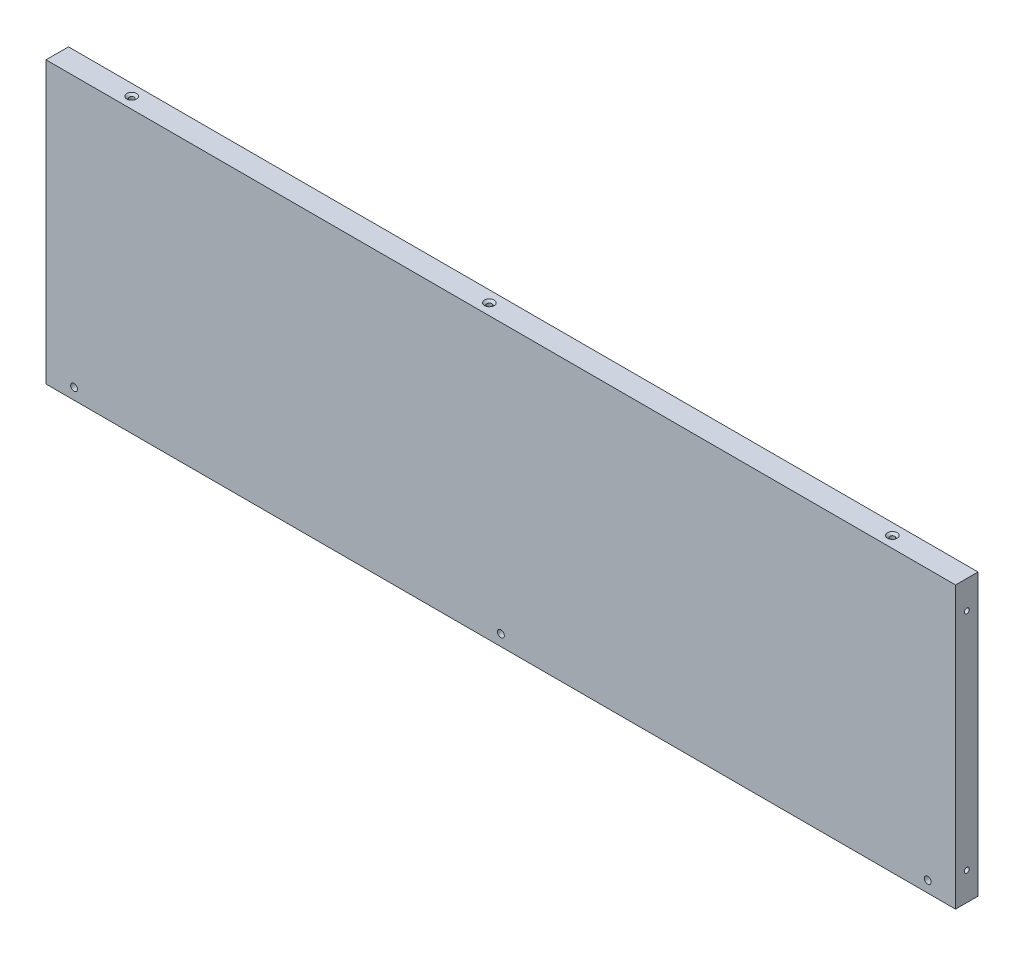
ISO-10303-21;
HEADER;
FILE_DESCRIPTION(('STEP AP214'),'2;1');
FILE_NAME('part.step','',(''),(''),'','','');
FILE_SCHEMA(('AUTOMOTIVE_DESIGN { 1 0 10303 214 1 1 1 1 }'));
ENDSEC;
DATA;
#1=APPLICATION_CONTEXT('core data for automotive mechanical design processes');
#2=APPLICATION_PROTOCOL_DEFINITION('international standard','automotive_design',2000,#1);
#3=PRODUCT_CONTEXT('',#1,'mechanical');
#4=PRODUCT('Part','Part','',(#3));
#5=PRODUCT_RELATED_PRODUCT_CATEGORY('part','',(#4));
#6=PRODUCT_DEFINITION_FORMATION('','',#4);
#7=PRODUCT_DEFINITION_CONTEXT('part definition',#1,'design');
#8=PRODUCT_DEFINITION('design','',#6,#7);
#9=PRODUCT_DEFINITION_SHAPE('','',#8);
#10=(LENGTH_UNIT() NAMED_UNIT(*) SI_UNIT(.MILLI.,.METRE.));
#11=(NAMED_UNIT(*) PLANE_ANGLE_UNIT() SI_UNIT($,.RADIAN.));
#12=(NAMED_UNIT(*) SI_UNIT($,.STERADIAN.) SOLID_ANGLE_UNIT());
#13=UNCERTAINTY_MEASURE_WITH_UNIT(LENGTH_MEASURE(1.E-05),#10,'distance_accuracy_value','');
#14=(GEOMETRIC_REPRESENTATION_CONTEXT(3) GLOBAL_UNCERTAINTY_ASSIGNED_CONTEXT((#13)) GLOBAL_UNIT_ASSIGNED_CONTEXT((#10,
#11,#12)) REPRESENTATION_CONTEXT('',''));
#15=CARTESIAN_POINT('',(0.,0.,0.));
#16=DIRECTION('',(0.,0.,1.));
#17=DIRECTION('',(1.,0.,0.));
#18=AXIS2_PLACEMENT_3D('',#15,#16,#17);
#19=CARTESIAN_POINT('',(0.,0.,8.));
#20=DIRECTION('',(0.,1.,0.));
#21=DIRECTION('',(0.,0.,1.));
#22=AXIS2_PLACEMENT_3D('',#19,#20,#21);
#23=PLANE('',#22);
#24=DIRECTION('',(0.,0.,-1.));
#25=VECTOR('',#24,1.);
#26=CARTESIAN_POINT('',(323.9,0.,8.));
#27=LINE('',#26,#25);
#28=CARTESIAN_POINT('',(323.9,0.,8.));
#29=VERTEX_POINT('',#28);
#30=CARTESIAN_POINT('',(323.9,0.,0.));
#31=VERTEX_POINT('',#30);
#32=EDGE_CURVE('E60',#29,#31,#27,.T.);
#33=ORIENTED_EDGE('',*,*,#32,.F.);
#34=DIRECTION('',(1.,0.,0.));
#35=VECTOR('',#34,1.);
#36=CARTESIAN_POINT('',(0.,0.,8.));
#37=LINE('',#36,#35);
#38=CARTESIAN_POINT('',(0.,0.,8.));
#39=VERTEX_POINT('',#38);
#40=EDGE_CURVE('E116',#39,#29,#37,.T.);
#41=ORIENTED_EDGE('',*,*,#40,.F.);
#42=DIRECTION('',(0.,0.,-1.));
#43=VECTOR('',#42,1.);
#44=CARTESIAN_POINT('',(0.,0.,8.));
#45=LINE('',#44,#43);
#46=CARTESIAN_POINT('',(0.,0.,0.));
#47=VERTEX_POINT('',#46);
#48=EDGE_CURVE('E11',#39,#47,#45,.T.);
#49=ORIENTED_EDGE('',*,*,#48,.T.);
#50=DIRECTION('',(1.,0.,0.));
#51=VECTOR('',#50,1.);
#52=CARTESIAN_POINT('',(0.,0.,0.));
#53=LINE('',#52,#51);
#54=EDGE_CURVE('E94',#47,#31,#53,.T.);
#55=ORIENTED_EDGE('',*,*,#54,.T.);
#56=EDGE_LOOP('',(#33,#41,#49,#55));
#57=FACE_BOUND('',#56,.T.);
#58=ADVANCED_FACE('F43',(#57),#23,.F.);
#59=CARTESIAN_POINT('',(0.,100.,8.));
#60=DIRECTION('',(0.,-1.,0.));
#61=DIRECTION('',(0.,0.,-1.));
#62=AXIS2_PLACEMENT_3D('',#59,#60,#61);
#63=PLANE('',#62);
#64=CARTESIAN_POINT('',(297.4,100.,4.));
#65=DIRECTION('',(0.,1.,0.));
#66=DIRECTION('',(0.,0.,1.));
#67=AXIS2_PLACEMENT_3D('',#64,#65,#66);
#68=CIRCLE('',#67,1.72719999999998);
#69=CARTESIAN_POINT('',(297.4,100.,5.72719999999998));
#70=VERTEX_POINT('',#69);
#71=EDGE_CURVE('E235',#70,#70,#68,.T.);
#72=ORIENTED_EDGE('',*,*,#71,.F.);
#73=EDGE_LOOP('',(#72));
#74=FACE_BOUND('',#73,.T.);
#75=CARTESIAN_POINT('',(153.9,100.,4.));
#76=DIRECTION('',(0.,1.,0.));
#77=DIRECTION('',(0.,0.,1.));
#78=AXIS2_PLACEMENT_3D('',#75,#76,#77);
#79=CIRCLE('',#78,1.72720000000001);
#80=CARTESIAN_POINT('',(153.9,100.,5.72720000000001));
#81=VERTEX_POINT('',#80);
#82=EDGE_CURVE('E223',#81,#81,#79,.T.);
#83=ORIENTED_EDGE('',*,*,#82,.F.);
#84=EDGE_LOOP('',(#83));
#85=FACE_BOUND('',#84,.T.);
#86=CARTESIAN_POINT('',(26.5,100.,4.));
#87=DIRECTION('',(0.,1.,0.));
#88=DIRECTION('',(0.,0.,1.));
#89=AXIS2_PLACEMENT_3D('',#86,#87,#88);
#90=CIRCLE('',#89,1.7272);
#91=CARTESIAN_POINT('',(26.5,100.,5.7272));
#92=VERTEX_POINT('',#91);
#93=EDGE_CURVE('E211',#92,#92,#90,.T.);
#94=ORIENTED_EDGE('',*,*,#93,.F.);
#95=EDGE_LOOP('',(#94));
#96=FACE_BOUND('',#95,.T.);
#97=DIRECTION('',(0.,0.,1.));
#98=VECTOR('',#97,1.);
#99=CARTESIAN_POINT('',(323.9,100.,8.));
#100=LINE('',#99,#98);
#101=CARTESIAN_POINT('',(323.9,100.,0.));
#102=VERTEX_POINT('',#101);
#103=CARTESIAN_POINT('',(323.9,100.,8.));
#104=VERTEX_POINT('',#103);
#105=EDGE_CURVE('E89',#102,#104,#100,.T.);
#106=ORIENTED_EDGE('',*,*,#105,.F.);
#107=DIRECTION('',(-1.,0.,0.));
#108=VECTOR('',#107,1.);
#109=CARTESIAN_POINT('',(0.,100.,0.));
#110=LINE('',#109,#108);
#111=CARTESIAN_POINT('',(0.,100.,0.));
#112=VERTEX_POINT('',#111);
#113=EDGE_CURVE('E83',#102,#112,#110,.T.);
#114=ORIENTED_EDGE('',*,*,#113,.T.);
#115=DIRECTION('',(0.,0.,-1.));
#116=VECTOR('',#115,1.);
#117=CARTESIAN_POINT('',(0.,100.,8.));
#118=LINE('',#117,#116);
#119=CARTESIAN_POINT('',(0.,100.,8.));
#120=VERTEX_POINT('',#119);
#121=EDGE_CURVE('E53',#120,#112,#118,.T.);
#122=ORIENTED_EDGE('',*,*,#121,.F.);
#123=DIRECTION('',(-1.,0.,0.));
#124=VECTOR('',#123,1.);
#125=CARTESIAN_POINT('',(0.,100.,8.));
#126=LINE('',#125,#124);
#127=EDGE_CURVE('E69',#104,#120,#126,.T.);
#128=ORIENTED_EDGE('',*,*,#127,.F.);
#129=EDGE_LOOP('',(#106,#114,#122,#128));
#130=FACE_BOUND('',#129,.T.);
#131=ADVANCED_FACE('F85',(#74,#85,#96,#130),#63,.F.);
#132=CARTESIAN_POINT('',(0.,0.,8.));
#133=DIRECTION('',(0.,0.,-1.));
#134=DIRECTION('',(-1.,0.,0.));
#135=AXIS2_PLACEMENT_3D('',#132,#133,#134);
#136=PLANE('',#135);
#137=CARTESIAN_POINT('',(162.,3.99999999999997,8.));
#138=DIRECTION('',(0.,0.,-1.));
#139=DIRECTION('',(-1.,0.,0.));
#140=AXIS2_PLACEMENT_3D('',#137,#138,#139);
#141=CIRCLE('',#140,1.2192);
#142=CARTESIAN_POINT('',(160.7808,3.99999999999997,8.));
#143=VERTEX_POINT('',#142);
#144=EDGE_CURVE('E105',#143,#143,#141,.T.);
#145=ORIENTED_EDGE('',*,*,#144,.T.);
#146=EDGE_LOOP('',(#145));
#147=FACE_BOUND('',#146,.T.);
#148=CARTESIAN_POINT('',(10.,4.,8.));
#149=DIRECTION('',(0.,0.,-1.));
#150=DIRECTION('',(-1.,0.,0.));
#151=AXIS2_PLACEMENT_3D('',#148,#149,#150);
#152=CIRCLE('',#151,1.2192);
#153=CARTESIAN_POINT('',(8.78080000000001,4.,8.));
#154=VERTEX_POINT('',#153);
#155=EDGE_CURVE('E133',#154,#154,#152,.T.);
#156=ORIENTED_EDGE('',*,*,#155,.T.);
#157=EDGE_LOOP('',(#156));
#158=FACE_BOUND('',#157,.T.);
#159=CARTESIAN_POINT('',(314.,3.99999999999994,8.));
#160=DIRECTION('',(0.,0.,-1.));
#161=DIRECTION('',(-1.,0.,0.));
#162=AXIS2_PLACEMENT_3D('',#159,#160,#161);
#163=CIRCLE('',#162,1.21919999999998);
#164=CARTESIAN_POINT('',(312.7808,3.99999999999994,8.));
#165=VERTEX_POINT('',#164);
#166=EDGE_CURVE('E149',#165,#165,#163,.T.);
#167=ORIENTED_EDGE('',*,*,#166,.T.);
#168=EDGE_LOOP('',(#167));
#169=FACE_BOUND('',#168,.T.);
#170=DIRECTION('',(0.,-1.,0.));
#171=VECTOR('',#170,1.);
#172=CARTESIAN_POINT('',(323.9,100.,8.));
#173=LINE('',#172,#171);
#174=EDGE_CURVE('E200',#104,#29,#173,.T.);
#175=ORIENTED_EDGE('',*,*,#174,.F.);
#176=ORIENTED_EDGE('',*,*,#127,.T.);
#177=DIRECTION('',(0.,-1.,0.));
#178=VECTOR('',#177,1.);
#179=CARTESIAN_POINT('',(0.,0.,8.));
#180=LINE('',#179,#178);
#181=EDGE_CURVE('E93',#120,#39,#180,.T.);
#182=ORIENTED_EDGE('',*,*,#181,.T.);
#183=ORIENTED_EDGE('',*,*,#40,.T.);
#184=EDGE_LOOP('',(#175,#176,#182,#183));
#185=FACE_BOUND('',#184,.T.);
#186=ADVANCED_FACE('F244',(#147,#158,#169,#185),#136,.F.);
#187=CARTESIAN_POINT('',(0.,0.,0.));
#188=DIRECTION('',(0.,0.,-1.));
#189=DIRECTION('',(-1.,0.,0.));
#190=AXIS2_PLACEMENT_3D('',#187,#188,#189);
#191=PLANE('',#190);
#192=CARTESIAN_POINT('',(314.,3.99999999999994,0.));
#193=DIRECTION('',(0.,0.,-1.));
#194=DIRECTION('',(-1.,0.,0.));
#195=AXIS2_PLACEMENT_3D('',#192,#193,#194);
#196=CIRCLE('',#195,2.38125);
#197=CARTESIAN_POINT('',(311.61875,3.99999999999994,0.));
#198=VERTEX_POINT('',#197);
#199=EDGE_CURVE('E161',#198,#198,#196,.T.);
#200=ORIENTED_EDGE('',*,*,#199,.F.);
#201=EDGE_LOOP('',(#200));
#202=FACE_BOUND('',#201,.T.);
#203=CARTESIAN_POINT('',(10.,4.,0.));
#204=DIRECTION('',(0.,0.,-1.));
#205=DIRECTION('',(-1.,0.,0.));
#206=AXIS2_PLACEMENT_3D('',#203,#204,#205);
#207=CIRCLE('',#206,2.38125);
#208=CARTESIAN_POINT('',(7.61875000000001,4.,0.));
#209=VERTEX_POINT('',#208);
#210=EDGE_CURVE('E145',#209,#209,#207,.T.);
#211=ORIENTED_EDGE('',*,*,#210,.F.);
#212=EDGE_LOOP('',(#211));
#213=FACE_BOUND('',#212,.T.);
#214=CARTESIAN_POINT('',(162.,3.99999999999997,0.));
#215=DIRECTION('',(0.,0.,-1.));
#216=DIRECTION('',(-1.,0.,0.));
#217=AXIS2_PLACEMENT_3D('',#214,#215,#216);
#218=CIRCLE('',#217,2.38125);
#219=CARTESIAN_POINT('',(159.61875,3.99999999999997,0.));
#220=VERTEX_POINT('',#219);
#221=EDGE_CURVE('E129',#220,#220,#218,.T.);
#222=ORIENTED_EDGE('',*,*,#221,.F.);
#223=EDGE_LOOP('',(#222));
#224=FACE_BOUND('',#223,.T.);
#225=ORIENTED_EDGE('',*,*,#113,.F.);
#226=DIRECTION('',(0.,1.,0.));
#227=VECTOR('',#226,1.);
#228=CARTESIAN_POINT('',(323.9,100.,0.));
#229=LINE('',#228,#227);
#230=EDGE_CURVE('E195',#31,#102,#229,.T.);
#231=ORIENTED_EDGE('',*,*,#230,.F.);
#232=ORIENTED_EDGE('',*,*,#54,.F.);
#233=DIRECTION('',(0.,-1.,0.));
#234=VECTOR('',#233,1.);
#235=CARTESIAN_POINT('',(0.,0.,0.));
#236=LINE('',#235,#234);
#237=EDGE_CURVE('E99',#112,#47,#236,.T.);
#238=ORIENTED_EDGE('',*,*,#237,.F.);
#239=EDGE_LOOP('',(#225,#231,#232,#238));
#240=FACE_BOUND('',#239,.T.);
#241=ADVANCED_FACE('F102',(#202,#213,#224,#240),#191,.T.);
#242=CARTESIAN_POINT('',(0.,0.,8.));
#243=DIRECTION('',(1.,0.,0.));
#244=DIRECTION('',(0.,0.,-1.));
#245=AXIS2_PLACEMENT_3D('',#242,#243,#244);
#246=PLANE('',#245);
#247=CARTESIAN_POINT('',(0.,90.,4.));
#248=DIRECTION('',(-1.,0.,0.));
#249=DIRECTION('',(0.,0.,1.));
#250=AXIS2_PLACEMENT_3D('',#247,#248,#249);
#251=CIRCLE('',#250,0.889000000000001);
#252=CARTESIAN_POINT('',(0.,90.,4.889));
#253=VERTEX_POINT('',#252);
#254=EDGE_CURVE('E185',#253,#253,#251,.T.);
#255=ORIENTED_EDGE('',*,*,#254,.F.);
#256=EDGE_LOOP('',(#255));
#257=FACE_BOUND('',#256,.T.);
#258=CARTESIAN_POINT('',(0.,10.,4.));
#259=DIRECTION('',(-1.,0.,0.));
#260=DIRECTION('',(0.,0.,1.));
#261=AXIS2_PLACEMENT_3D('',#258,#259,#260);
#262=CIRCLE('',#261,0.888999999999997);
#263=CARTESIAN_POINT('',(0.,10.,4.889));
#264=VERTEX_POINT('',#263);
#265=EDGE_CURVE('E177',#264,#264,#262,.T.);
#266=ORIENTED_EDGE('',*,*,#265,.F.);
#267=EDGE_LOOP('',(#266));
#268=FACE_BOUND('',#267,.T.);
#269=ORIENTED_EDGE('',*,*,#237,.T.);
#270=ORIENTED_EDGE('',*,*,#48,.F.);
#271=ORIENTED_EDGE('',*,*,#181,.F.);
#272=ORIENTED_EDGE('',*,*,#121,.T.);
#273=EDGE_LOOP('',(#269,#270,#271,#272));
#274=FACE_BOUND('',#273,.T.);
#275=ADVANCED_FACE('F45',(#257,#268,#274),#246,.F.);
#276=CARTESIAN_POINT('',(162.,3.99999999999997,0.));
#277=DIRECTION('',(0.,0.,-1.));
#278=DIRECTION('',(-1.,0.,0.));
#279=AXIS2_PLACEMENT_3D('',#276,#277,#278);
#280=CYLINDRICAL_SURFACE('',#279,1.2192);
#281=ORIENTED_EDGE('',*,*,#144,.F.);
#282=EDGE_LOOP('',(#281));
#283=FACE_BOUND('',#282,.T.);
#284=CARTESIAN_POINT('',(162.,3.99999999999997,2.1844));
#285=DIRECTION('',(0.,0.,-1.));
#286=DIRECTION('',(-1.,0.,0.));
#287=AXIS2_PLACEMENT_3D('',#284,#285,#286);
#288=CIRCLE('',#287,1.2192);
#289=CARTESIAN_POINT('',(160.7808,3.99999999999997,2.1844));
#290=VERTEX_POINT('',#289);
#291=EDGE_CURVE('E111',#290,#290,#288,.T.);
#292=ORIENTED_EDGE('',*,*,#291,.T.);
#293=EDGE_LOOP('',(#292));
#294=FACE_BOUND('',#293,.T.);
#295=ADVANCED_FACE('F279',(#283,#294),#280,.F.);
#296=CARTESIAN_POINT('',(163.2192,3.99999999999997,2.1844));
#297=DIRECTION('',(0.,0.,1.));
#298=DIRECTION('',(1.,0.,0.));
#299=AXIS2_PLACEMENT_3D('',#296,#297,#298);
#300=PLANE('',#299);
#301=ORIENTED_EDGE('',*,*,#291,.F.);
#302=EDGE_LOOP('',(#301));
#303=FACE_BOUND('',#302,.T.);
#304=CARTESIAN_POINT('',(162.,3.99999999999997,2.1844));
#305=DIRECTION('',(0.,0.,-1.));
#306=DIRECTION('',(-1.,0.,0.));
#307=AXIS2_PLACEMENT_3D('',#304,#305,#306);
#308=CIRCLE('',#307,2.38125);
#309=CARTESIAN_POINT('',(159.61875,3.99999999999997,2.1844));
#310=VERTEX_POINT('',#309);
#311=EDGE_CURVE('E125',#310,#310,#308,.T.);
#312=ORIENTED_EDGE('',*,*,#311,.T.);
#313=EDGE_LOOP('',(#312));
#314=FACE_BOUND('',#313,.T.);
#315=ADVANCED_FACE('F282',(#303,#314),#300,.F.);
#316=CARTESIAN_POINT('',(162.,3.99999999999997,0.));
#317=DIRECTION('',(0.,0.,-1.));
#318=DIRECTION('',(-1.,0.,0.));
#319=AXIS2_PLACEMENT_3D('',#316,#317,#318);
#320=CYLINDRICAL_SURFACE('',#319,2.38125);
#321=ORIENTED_EDGE('',*,*,#311,.F.);
#322=EDGE_LOOP('',(#321));
#323=FACE_BOUND('',#322,.T.);
#324=ORIENTED_EDGE('',*,*,#221,.T.);
#325=EDGE_LOOP('',(#324));
#326=FACE_BOUND('',#325,.T.);
#327=ADVANCED_FACE('F286',(#323,#326),#320,.F.);
#328=CARTESIAN_POINT('',(10.,4.,0.));
#329=DIRECTION('',(0.,0.,-1.));
#330=DIRECTION('',(-1.,0.,0.));
#331=AXIS2_PLACEMENT_3D('',#328,#329,#330);
#332=CYLINDRICAL_SURFACE('',#331,1.2192);
#333=ORIENTED_EDGE('',*,*,#155,.F.);
#334=EDGE_LOOP('',(#333));
#335=FACE_BOUND('',#334,.T.);
#336=CARTESIAN_POINT('',(10.,4.,2.1844));
#337=DIRECTION('',(0.,0.,-1.));
#338=DIRECTION('',(-1.,0.,0.));
#339=AXIS2_PLACEMENT_3D('',#336,#337,#338);
#340=CIRCLE('',#339,1.2192);
#341=CARTESIAN_POINT('',(8.78080000000001,4.,2.1844));
#342=VERTEX_POINT('',#341);
#343=EDGE_CURVE('E137',#342,#342,#340,.T.);
#344=ORIENTED_EDGE('',*,*,#343,.T.);
#345=EDGE_LOOP('',(#344));
#346=FACE_BOUND('',#345,.T.);
#347=ADVANCED_FACE('F290',(#335,#346),#332,.F.);
#348=CARTESIAN_POINT('',(11.2192,4.,2.1844));
#349=DIRECTION('',(0.,0.,1.));
#350=DIRECTION('',(1.,0.,0.));
#351=AXIS2_PLACEMENT_3D('',#348,#349,#350);
#352=PLANE('',#351);
#353=ORIENTED_EDGE('',*,*,#343,.F.);
#354=EDGE_LOOP('',(#353));
#355=FACE_BOUND('',#354,.T.);
#356=CARTESIAN_POINT('',(10.,4.,2.1844));
#357=DIRECTION('',(0.,0.,-1.));
#358=DIRECTION('',(-1.,0.,0.));
#359=AXIS2_PLACEMENT_3D('',#356,#357,#358);
#360=CIRCLE('',#359,2.38125);
#361=CARTESIAN_POINT('',(7.61875000000001,4.,2.1844));
#362=VERTEX_POINT('',#361);
#363=EDGE_CURVE('E141',#362,#362,#360,.T.);
#364=ORIENTED_EDGE('',*,*,#363,.T.);
#365=EDGE_LOOP('',(#364));
#366=FACE_BOUND('',#365,.T.);
#367=ADVANCED_FACE('F294',(#355,#366),#352,.F.);
#368=CARTESIAN_POINT('',(10.,4.,0.));
#369=DIRECTION('',(0.,0.,-1.));
#370=DIRECTION('',(-1.,0.,0.));
#371=AXIS2_PLACEMENT_3D('',#368,#369,#370);
#372=CYLINDRICAL_SURFACE('',#371,2.38125);
#373=ORIENTED_EDGE('',*,*,#363,.F.);
#374=EDGE_LOOP('',(#373));
#375=FACE_BOUND('',#374,.T.);
#376=ORIENTED_EDGE('',*,*,#210,.T.);
#377=EDGE_LOOP('',(#376));
#378=FACE_BOUND('',#377,.T.);
#379=ADVANCED_FACE('F298',(#375,#378),#372,.F.);
#380=CARTESIAN_POINT('',(314.,3.99999999999994,0.));
#381=DIRECTION('',(0.,0.,-1.));
#382=DIRECTION('',(-1.,0.,0.));
#383=AXIS2_PLACEMENT_3D('',#380,#381,#382);
#384=CYLINDRICAL_SURFACE('',#383,1.21919999999998);
#385=ORIENTED_EDGE('',*,*,#166,.F.);
#386=EDGE_LOOP('',(#385));
#387=FACE_BOUND('',#386,.T.);
#388=CARTESIAN_POINT('',(314.,3.99999999999994,2.1844));
#389=DIRECTION('',(0.,0.,-1.));
#390=DIRECTION('',(-1.,0.,0.));
#391=AXIS2_PLACEMENT_3D('',#388,#389,#390);
#392=CIRCLE('',#391,1.21919999999998);
#393=CARTESIAN_POINT('',(312.7808,3.99999999999994,2.1844));
#394=VERTEX_POINT('',#393);
#395=EDGE_CURVE('E153',#394,#394,#392,.T.);
#396=ORIENTED_EDGE('',*,*,#395,.T.);
#397=EDGE_LOOP('',(#396));
#398=FACE_BOUND('',#397,.T.);
#399=ADVANCED_FACE('F302',(#387,#398),#384,.F.);
#400=CARTESIAN_POINT('',(315.2192,3.99999999999994,2.1844));
#401=DIRECTION('',(0.,0.,1.));
#402=DIRECTION('',(1.,0.,0.));
#403=AXIS2_PLACEMENT_3D('',#400,#401,#402);
#404=PLANE('',#403);
#405=ORIENTED_EDGE('',*,*,#395,.F.);
#406=EDGE_LOOP('',(#405));
#407=FACE_BOUND('',#406,.T.);
#408=CARTESIAN_POINT('',(314.,3.99999999999994,2.1844));
#409=DIRECTION('',(0.,0.,-1.));
#410=DIRECTION('',(-1.,0.,0.));
#411=AXIS2_PLACEMENT_3D('',#408,#409,#410);
#412=CIRCLE('',#411,2.38125);
#413=CARTESIAN_POINT('',(311.61875,3.99999999999994,2.1844));
#414=VERTEX_POINT('',#413);
#415=EDGE_CURVE('E157',#414,#414,#412,.T.);
#416=ORIENTED_EDGE('',*,*,#415,.T.);
#417=EDGE_LOOP('',(#416));
#418=FACE_BOUND('',#417,.T.);
#419=ADVANCED_FACE('F306',(#407,#418),#404,.F.);
#420=CARTESIAN_POINT('',(314.,3.99999999999994,0.));
#421=DIRECTION('',(0.,0.,-1.));
#422=DIRECTION('',(-1.,0.,0.));
#423=AXIS2_PLACEMENT_3D('',#420,#421,#422);
#424=CYLINDRICAL_SURFACE('',#423,2.38125);
#425=ORIENTED_EDGE('',*,*,#415,.F.);
#426=EDGE_LOOP('',(#425));
#427=FACE_BOUND('',#426,.T.);
#428=ORIENTED_EDGE('',*,*,#199,.T.);
#429=EDGE_LOOP('',(#428));
#430=FACE_BOUND('',#429,.T.);
#431=ADVANCED_FACE('F310',(#427,#430),#424,.F.);
#432=CARTESIAN_POINT('',(15.,10.,4.));
#433=DIRECTION('',(-1.,0.,0.));
#434=DIRECTION('',(0.,0.,1.));
#435=AXIS2_PLACEMENT_3D('',#432,#433,#434);
#436=CONICAL_SURFACE('',#435,0.888999999999996,1.02974425867665);
#437=CARTESIAN_POINT('',(15.5341650903155,10.,4.));
#438=VERTEX_POINT('',#437);
#439=VERTEX_LOOP('',#438);
#440=FACE_BOUND('',#439,.T.);
#441=CARTESIAN_POINT('',(15.,10.,4.));
#442=DIRECTION('',(-1.,0.,0.));
#443=DIRECTION('',(0.,0.,1.));
#444=AXIS2_PLACEMENT_3D('',#441,#442,#443);
#445=CIRCLE('',#444,0.888999999999996);
#446=CARTESIAN_POINT('',(15.,10.,4.889));
#447=VERTEX_POINT('',#446);
#448=EDGE_CURVE('E173',#447,#447,#445,.T.);
#449=ORIENTED_EDGE('',*,*,#448,.T.);
#450=EDGE_LOOP('',(#449));
#451=FACE_BOUND('',#450,.T.);
#452=ADVANCED_FACE('F314',(#440,#451),#436,.F.);
#453=CARTESIAN_POINT('',(0.,10.,4.));
#454=DIRECTION('',(-1.,0.,0.));
#455=DIRECTION('',(0.,0.,1.));
#456=AXIS2_PLACEMENT_3D('',#453,#454,#455);
#457=CYLINDRICAL_SURFACE('',#456,0.888999999999997);
#458=ORIENTED_EDGE('',*,*,#448,.F.);
#459=EDGE_LOOP('',(#458));
#460=FACE_BOUND('',#459,.T.);
#461=ORIENTED_EDGE('',*,*,#265,.T.);
#462=EDGE_LOOP('',(#461));
#463=FACE_BOUND('',#462,.T.);
#464=ADVANCED_FACE('F335',(#460,#463),#457,.F.);
#465=CARTESIAN_POINT('',(15.,90.,4.));
#466=DIRECTION('',(-1.,0.,0.));
#467=DIRECTION('',(0.,0.,1.));
#468=AXIS2_PLACEMENT_3D('',#465,#466,#467);
#469=CONICAL_SURFACE('',#468,0.889000000000001,1.02974425867665);
#470=CARTESIAN_POINT('',(15.5341650903155,90.,4.));
#471=VERTEX_POINT('',#470);
#472=VERTEX_LOOP('',#471);
#473=FACE_BOUND('',#472,.T.);
#474=CARTESIAN_POINT('',(15.,90.,4.));
#475=DIRECTION('',(-1.,0.,0.));
#476=DIRECTION('',(0.,0.,1.));
#477=AXIS2_PLACEMENT_3D('',#474,#475,#476);
#478=CIRCLE('',#477,0.889000000000001);
#479=CARTESIAN_POINT('',(15.,90.,4.889));
#480=VERTEX_POINT('',#479);
#481=EDGE_CURVE('E181',#480,#480,#478,.T.);
#482=ORIENTED_EDGE('',*,*,#481,.T.);
#483=EDGE_LOOP('',(#482));
#484=FACE_BOUND('',#483,.T.);
#485=ADVANCED_FACE('F339',(#473,#484),#469,.F.);
#486=CARTESIAN_POINT('',(0.,90.,4.));
#487=DIRECTION('',(-1.,0.,0.));
#488=DIRECTION('',(0.,0.,1.));
#489=AXIS2_PLACEMENT_3D('',#486,#487,#488);
#490=CYLINDRICAL_SURFACE('',#489,0.889000000000001);
#491=ORIENTED_EDGE('',*,*,#481,.F.);
#492=EDGE_LOOP('',(#491));
#493=FACE_BOUND('',#492,.T.);
#494=ORIENTED_EDGE('',*,*,#254,.T.);
#495=EDGE_LOOP('',(#494));
#496=FACE_BOUND('',#495,.T.);
#497=ADVANCED_FACE('F343',(#493,#496),#490,.F.);
#498=CARTESIAN_POINT('',(323.9,0.,0.));
#499=DIRECTION('',(1.,0.,0.));
#500=DIRECTION('',(0.,0.,-1.));
#501=AXIS2_PLACEMENT_3D('',#498,#499,#500);
#502=PLANE('',#501);
#503=ORIENTED_EDGE('',*,*,#174,.T.);
#504=ORIENTED_EDGE('',*,*,#32,.T.);
#505=ORIENTED_EDGE('',*,*,#230,.T.);
#506=ORIENTED_EDGE('',*,*,#105,.T.);
#507=EDGE_LOOP('',(#503,#504,#505,#506));
#508=FACE_BOUND('',#507,.T.);
#509=CARTESIAN_POINT('',(323.9,90.,4.));
#510=DIRECTION('',(1.,0.,0.));
#511=DIRECTION('',(0.,0.,-1.));
#512=AXIS2_PLACEMENT_3D('',#509,#510,#511);
#513=CIRCLE('',#512,0.889000000000001);
#514=CARTESIAN_POINT('',(323.9,90.,3.111));
#515=VERTEX_POINT('',#514);
#516=EDGE_CURVE('E47',#515,#515,#513,.F.);
#517=ORIENTED_EDGE('',*,*,#516,.T.);
#518=EDGE_LOOP('',(#517));
#519=FACE_BOUND('',#518,.T.);
#520=CARTESIAN_POINT('',(323.9,10.,4.));
#521=DIRECTION('',(1.,0.,0.));
#522=DIRECTION('',(0.,0.,-1.));
#523=AXIS2_PLACEMENT_3D('',#520,#521,#522);
#524=CIRCLE('',#523,0.888999999999997);
#525=CARTESIAN_POINT('',(323.9,10.,3.111));
#526=VERTEX_POINT('',#525);
#527=EDGE_CURVE('E189',#526,#526,#524,.F.);
#528=ORIENTED_EDGE('',*,*,#527,.T.);
#529=EDGE_LOOP('',(#528));
#530=FACE_BOUND('',#529,.T.);
#531=ADVANCED_FACE('F320',(#508,#519,#530),#502,.T.);
#532=CARTESIAN_POINT('',(309.,10.,4.));
#533=DIRECTION('',(1.,0.,0.));
#534=DIRECTION('',(0.,0.,-1.));
#535=AXIS2_PLACEMENT_3D('',#532,#533,#534);
#536=CONICAL_SURFACE('',#535,0.888999999999996,1.02974425867664);
#537=CARTESIAN_POINT('',(308.465834909684,10.,4.));
#538=VERTEX_POINT('',#537);
#539=VERTEX_LOOP('',#538);
#540=FACE_BOUND('',#539,.T.);
#541=CARTESIAN_POINT('',(309.,10.,4.));
#542=DIRECTION('',(1.,0.,0.));
#543=DIRECTION('',(0.,0.,-1.));
#544=AXIS2_PLACEMENT_3D('',#541,#542,#543);
#545=CIRCLE('',#544,0.888999999999996);
#546=CARTESIAN_POINT('',(309.,10.,3.111));
#547=VERTEX_POINT('',#546);
#548=EDGE_CURVE('E165',#547,#547,#545,.T.);
#549=ORIENTED_EDGE('',*,*,#548,.T.);
#550=EDGE_LOOP('',(#549));
#551=FACE_BOUND('',#550,.T.);
#552=ADVANCED_FACE('F316',(#540,#551),#536,.F.);
#553=CARTESIAN_POINT('',(324.,10.,4.));
#554=DIRECTION('',(1.,0.,0.));
#555=DIRECTION('',(0.,0.,-1.));
#556=AXIS2_PLACEMENT_3D('',#553,#554,#555);
#557=CYLINDRICAL_SURFACE('',#556,0.888999999999997);
#558=ORIENTED_EDGE('',*,*,#548,.F.);
#559=EDGE_LOOP('',(#558));
#560=FACE_BOUND('',#559,.T.);
#561=ORIENTED_EDGE('',*,*,#527,.F.);
#562=EDGE_LOOP('',(#561));
#563=FACE_BOUND('',#562,.T.);
#564=ADVANCED_FACE('F319',(#560,#563),#557,.F.);
#565=CARTESIAN_POINT('',(309.,90.,4.));
#566=DIRECTION('',(1.,0.,0.));
#567=DIRECTION('',(0.,0.,-1.));
#568=AXIS2_PLACEMENT_3D('',#565,#566,#567);
#569=CONICAL_SURFACE('',#568,0.889000000000001,1.02974425867665);
#570=CARTESIAN_POINT('',(308.465834909684,90.,4.));
#571=VERTEX_POINT('',#570);
#572=VERTEX_LOOP('',#571);
#573=FACE_BOUND('',#572,.T.);
#574=CARTESIAN_POINT('',(309.,90.,4.));
#575=DIRECTION('',(1.,0.,0.));
#576=DIRECTION('',(0.,0.,-1.));
#577=AXIS2_PLACEMENT_3D('',#574,#575,#576);
#578=CIRCLE('',#577,0.889000000000001);
#579=CARTESIAN_POINT('',(309.,90.,3.111));
#580=VERTEX_POINT('',#579);
#581=EDGE_CURVE('E169',#580,#580,#578,.T.);
#582=ORIENTED_EDGE('',*,*,#581,.T.);
#583=EDGE_LOOP('',(#582));
#584=FACE_BOUND('',#583,.T.);
#585=ADVANCED_FACE('F324',(#573,#584),#569,.F.);
#586=CARTESIAN_POINT('',(324.,90.,4.));
#587=DIRECTION('',(1.,0.,0.));
#588=DIRECTION('',(0.,0.,-1.));
#589=AXIS2_PLACEMENT_3D('',#586,#587,#588);
#590=CYLINDRICAL_SURFACE('',#589,0.889000000000001);
#591=ORIENTED_EDGE('',*,*,#581,.F.);
#592=EDGE_LOOP('',(#591));
#593=FACE_BOUND('',#592,.T.);
#594=ORIENTED_EDGE('',*,*,#516,.F.);
#595=EDGE_LOOP('',(#594));
#596=FACE_BOUND('',#595,.T.);
#597=ADVANCED_FACE('F328',(#593,#596),#590,.F.);
#598=CARTESIAN_POINT('',(26.5,94.27,4.));
#599=DIRECTION('',(0.,1.,0.));
#600=DIRECTION('',(0.,0.,1.));
#601=AXIS2_PLACEMENT_3D('',#598,#599,#600);
#602=CONICAL_SURFACE('',#601,0.888999999999997,1.02974425867665);
#603=CARTESIAN_POINT('',(26.5,93.7358349096845,4.));
#604=VERTEX_POINT('',#603);
#605=VERTEX_LOOP('',#604);
#606=FACE_BOUND('',#605,.T.);
#607=CARTESIAN_POINT('',(26.5,94.27,4.));
#608=DIRECTION('',(0.,1.,0.));
#609=DIRECTION('',(0.,0.,1.));
#610=AXIS2_PLACEMENT_3D('',#607,#608,#609);
#611=CIRCLE('',#610,0.888999999999997);
#612=CARTESIAN_POINT('',(26.5,94.27,4.889));
#613=VERTEX_POINT('',#612);
#614=EDGE_CURVE('E203',#613,#613,#611,.T.);
#615=ORIENTED_EDGE('',*,*,#614,.T.);
#616=EDGE_LOOP('',(#615));
#617=FACE_BOUND('',#616,.T.);
#618=ADVANCED_FACE('F263',(#606,#617),#602,.F.);
#619=CARTESIAN_POINT('',(26.5,100.,4.));
#620=DIRECTION('',(0.,1.,0.));
#621=DIRECTION('',(0.,0.,1.));
#622=AXIS2_PLACEMENT_3D('',#619,#620,#621);
#623=CYLINDRICAL_SURFACE('',#622,0.888999999999999);
#624=ORIENTED_EDGE('',*,*,#614,.F.);
#625=EDGE_LOOP('',(#624));
#626=FACE_BOUND('',#625,.T.);
#627=CARTESIAN_POINT('',(26.5,99.2966666891472,4.));
#628=DIRECTION('',(0.,1.,0.));
#629=DIRECTION('',(0.,0.,1.));
#630=AXIS2_PLACEMENT_3D('',#627,#628,#629);
#631=CIRCLE('',#630,0.889000000000001);
#632=CARTESIAN_POINT('',(26.5,99.2966666891472,4.889));
#633=VERTEX_POINT('',#632);
#634=EDGE_CURVE('E207',#633,#633,#631,.T.);
#635=ORIENTED_EDGE('',*,*,#634,.T.);
#636=EDGE_LOOP('',(#635));
#637=FACE_BOUND('',#636,.T.);
#638=ADVANCED_FACE('F253',(#626,#637),#623,.F.);
#639=CARTESIAN_POINT('',(26.5,100.,4.));
#640=DIRECTION('',(0.,1.,0.));
#641=DIRECTION('',(0.,0.,1.));
#642=AXIS2_PLACEMENT_3D('',#639,#640,#641);
#643=CONICAL_SURFACE('',#642,1.7272,0.872664625997161);
#644=ORIENTED_EDGE('',*,*,#634,.F.);
#645=EDGE_LOOP('',(#644));
#646=FACE_BOUND('',#645,.T.);
#647=ORIENTED_EDGE('',*,*,#93,.T.);
#648=EDGE_LOOP('',(#647));
#649=FACE_BOUND('',#648,.T.);
#650=ADVANCED_FACE('F250',(#646,#649),#643,.F.);
#651=CARTESIAN_POINT('',(153.9,94.27,4.));
#652=DIRECTION('',(0.,1.,0.));
#653=DIRECTION('',(0.,0.,1.));
#654=AXIS2_PLACEMENT_3D('',#651,#652,#653);
#655=CONICAL_SURFACE('',#654,0.889000000000001,1.02974425867665);
#656=CARTESIAN_POINT('',(153.9,93.7358349096845,4.));
#657=VERTEX_POINT('',#656);
#658=VERTEX_LOOP('',#657);
#659=FACE_BOUND('',#658,.T.);
#660=CARTESIAN_POINT('',(153.9,94.27,4.));
#661=DIRECTION('',(0.,1.,0.));
#662=DIRECTION('',(0.,0.,1.));
#663=AXIS2_PLACEMENT_3D('',#660,#661,#662);
#664=CIRCLE('',#663,0.889000000000001);
#665=CARTESIAN_POINT('',(153.9,94.27,4.889));
#666=VERTEX_POINT('',#665);
#667=EDGE_CURVE('E215',#666,#666,#664,.T.);
#668=ORIENTED_EDGE('',*,*,#667,.T.);
#669=EDGE_LOOP('',(#668));
#670=FACE_BOUND('',#669,.T.);
#671=ADVANCED_FACE('F252',(#659,#670),#655,.F.);
#672=CARTESIAN_POINT('',(153.9,100.,4.));
#673=DIRECTION('',(0.,1.,0.));
#674=DIRECTION('',(0.,0.,1.));
#675=AXIS2_PLACEMENT_3D('',#672,#673,#674);
#676=CYLINDRICAL_SURFACE('',#675,0.889000000000001);
#677=ORIENTED_EDGE('',*,*,#667,.F.);
#678=EDGE_LOOP('',(#677));
#679=FACE_BOUND('',#678,.T.);
#680=CARTESIAN_POINT('',(153.9,99.2966666891472,4.));
#681=DIRECTION('',(0.,1.,0.));
#682=DIRECTION('',(0.,0.,1.));
#683=AXIS2_PLACEMENT_3D('',#680,#681,#682);
#684=CIRCLE('',#683,0.889000000000001);
#685=CARTESIAN_POINT('',(153.9,99.2966666891472,4.889));
#686=VERTEX_POINT('',#685);
#687=EDGE_CURVE('E219',#686,#686,#684,.T.);
#688=ORIENTED_EDGE('',*,*,#687,.T.);
#689=EDGE_LOOP('',(#688));
#690=FACE_BOUND('',#689,.T.);
#691=ADVANCED_FACE('F260',(#679,#690),#676,.F.);
#692=CARTESIAN_POINT('',(153.9,100.,4.));
#693=DIRECTION('',(0.,1.,0.));
#694=DIRECTION('',(0.,0.,1.));
#695=AXIS2_PLACEMENT_3D('',#692,#693,#694);
#696=CONICAL_SURFACE('',#695,1.72720000000001,0.872664625997167);
#697=ORIENTED_EDGE('',*,*,#687,.F.);
#698=EDGE_LOOP('',(#697));
#699=FACE_BOUND('',#698,.T.);
#700=ORIENTED_EDGE('',*,*,#82,.T.);
#701=EDGE_LOOP('',(#700));
#702=FACE_BOUND('',#701,.T.);
#703=ADVANCED_FACE('F529',(#699,#702),#696,.F.);
#704=CARTESIAN_POINT('',(297.4,94.27,4.));
#705=DIRECTION('',(0.,1.,0.));
#706=DIRECTION('',(0.,0.,1.));
#707=AXIS2_PLACEMENT_3D('',#704,#705,#706);
#708=CONICAL_SURFACE('',#707,0.888999999999973,1.02974425867664);
#709=CARTESIAN_POINT('',(297.4,93.7358349096845,4.));
#710=VERTEX_POINT('',#709);
#711=VERTEX_LOOP('',#710);
#712=FACE_BOUND('',#711,.T.);
#713=CARTESIAN_POINT('',(297.4,94.27,4.));
#714=DIRECTION('',(0.,1.,0.));
#715=DIRECTION('',(0.,0.,1.));
#716=AXIS2_PLACEMENT_3D('',#713,#714,#715);
#717=CIRCLE('',#716,0.888999999999973);
#718=CARTESIAN_POINT('',(297.4,94.27,4.88899999999997));
#719=VERTEX_POINT('',#718);
#720=EDGE_CURVE('E227',#719,#719,#717,.T.);
#721=ORIENTED_EDGE('',*,*,#720,.T.);
#722=EDGE_LOOP('',(#721));
#723=FACE_BOUND('',#722,.T.);
#724=ADVANCED_FACE('F542',(#712,#723),#708,.F.);
#725=CARTESIAN_POINT('',(297.4,100.,4.));
#726=DIRECTION('',(0.,1.,0.));
#727=DIRECTION('',(0.,0.,1.));
#728=AXIS2_PLACEMENT_3D('',#725,#726,#727);
#729=CYLINDRICAL_SURFACE('',#728,0.888999999999973);
#730=ORIENTED_EDGE('',*,*,#720,.F.);
#731=EDGE_LOOP('',(#730));
#732=FACE_BOUND('',#731,.T.);
#733=CARTESIAN_POINT('',(297.4,99.2966666891472,4.));
#734=DIRECTION('',(0.,1.,0.));
#735=DIRECTION('',(0.,0.,1.));
#736=AXIS2_PLACEMENT_3D('',#733,#734,#735);
#737=CIRCLE('',#736,0.888999999999973);
#738=CARTESIAN_POINT('',(297.4,99.2966666891472,4.88899999999997));
#739=VERTEX_POINT('',#738);
#740=EDGE_CURVE('E231',#739,#739,#737,.T.);
#741=ORIENTED_EDGE('',*,*,#740,.T.);
#742=EDGE_LOOP('',(#741));
#743=FACE_BOUND('',#742,.T.);
#744=ADVANCED_FACE('F538',(#732,#743),#729,.F.);
#745=CARTESIAN_POINT('',(297.4,100.,4.));
#746=DIRECTION('',(0.,1.,0.));
#747=DIRECTION('',(0.,0.,1.));
#748=AXIS2_PLACEMENT_3D('',#745,#746,#747);
#749=CONICAL_SURFACE('',#748,1.72719999999998,0.872664625997167);
#750=ORIENTED_EDGE('',*,*,#740,.F.);
#751=EDGE_LOOP('',(#750));
#752=FACE_BOUND('',#751,.T.);
#753=ORIENTED_EDGE('',*,*,#71,.T.);
#754=EDGE_LOOP('',(#753));
#755=FACE_BOUND('',#754,.T.);
#756=ADVANCED_FACE('F240',(#752,#755),#749,.F.);
#757=CLOSED_SHELL('',(#58,#131,#186,#241,#275,#295,#315,#327,#347,#367,#379,#399,#419,#431,#452,
#464,#485,#497,#531,#552,#564,#585,#597,#618,#638,#650,#671,#691,#703,#724,#744,#756));
#758=MANIFOLD_SOLID_BREP('B2',#757);
#759=ADVANCED_BREP_SHAPE_REPRESENTATION('',(#18,#758),#14);
#760=SHAPE_DEFINITION_REPRESENTATION(#9,#759);
ENDSEC;
END-ISO-10303-21;
